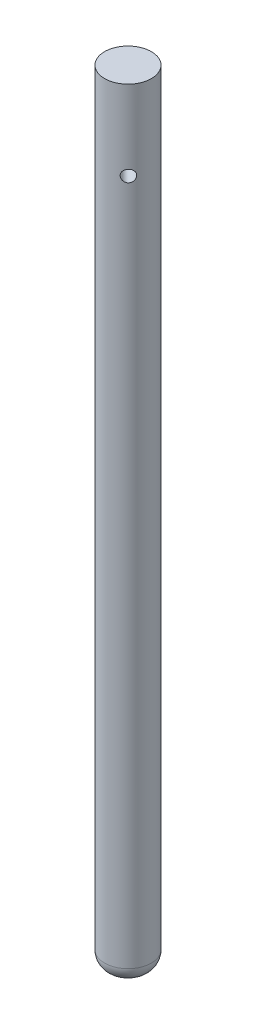
ISO-10303-21;
HEADER;
FILE_DESCRIPTION(('STEP AP214'),'2;1');
FILE_NAME('part.step','',(''),(''),'','','');
FILE_SCHEMA(('AUTOMOTIVE_DESIGN { 1 0 10303 214 1 1 1 1 }'));
ENDSEC;
DATA;
#1=APPLICATION_CONTEXT('core data for automotive mechanical design processes');
#2=APPLICATION_PROTOCOL_DEFINITION('international standard','automotive_design',2000,#1);
#3=PRODUCT_CONTEXT('',#1,'mechanical');
#4=PRODUCT('Part','Part','',(#3));
#5=PRODUCT_RELATED_PRODUCT_CATEGORY('part','',(#4));
#6=PRODUCT_DEFINITION_FORMATION('','',#4);
#7=PRODUCT_DEFINITION_CONTEXT('part definition',#1,'design');
#8=PRODUCT_DEFINITION('design','',#6,#7);
#9=PRODUCT_DEFINITION_SHAPE('','',#8);
#10=(LENGTH_UNIT() NAMED_UNIT(*) SI_UNIT(.MILLI.,.METRE.));
#11=(NAMED_UNIT(*) PLANE_ANGLE_UNIT() SI_UNIT($,.RADIAN.));
#12=(NAMED_UNIT(*) SI_UNIT($,.STERADIAN.) SOLID_ANGLE_UNIT());
#13=UNCERTAINTY_MEASURE_WITH_UNIT(LENGTH_MEASURE(1.E-05),#10,'distance_accuracy_value','');
#14=(GEOMETRIC_REPRESENTATION_CONTEXT(3) GLOBAL_UNCERTAINTY_ASSIGNED_CONTEXT((#13)) GLOBAL_UNIT_ASSIGNED_CONTEXT((#10,
#11,#12)) REPRESENTATION_CONTEXT('',''));
#15=CARTESIAN_POINT('',(0.,0.,0.));
#16=DIRECTION('',(0.,0.,1.));
#17=DIRECTION('',(1.,0.,0.));
#18=AXIS2_PLACEMENT_3D('',#15,#16,#17);
#19=CARTESIAN_POINT('',(0.,100.,0.));
#20=DIRECTION('',(0.,-1.,0.));
#21=DIRECTION('',(0.,0.,-1.));
#22=AXIS2_PLACEMENT_3D('',#19,#20,#21);
#23=CYLINDRICAL_SURFACE('',#22,2.99);
#24=CARTESIAN_POINT('',(0.,2.,0.));
#25=DIRECTION('',(0.,1.,0.));
#26=DIRECTION('',(0.,0.,1.));
#27=AXIS2_PLACEMENT_3D('',#24,#25,#26);
#28=CIRCLE('',#27,2.99);
#29=CARTESIAN_POINT('',(0.,2.,2.99));
#30=VERTEX_POINT('',#29);
#31=EDGE_CURVE('E38',#30,#30,#28,.T.);
#32=ORIENTED_EDGE('',*,*,#31,.T.);
#33=EDGE_LOOP('',(#32));
#34=FACE_BOUND('',#33,.T.);
#35=CARTESIAN_POINT('',(-1.55299666851545,89.8183221412136,-2.55505407918892));
#36=CARTESIAN_POINT('',(-1.55299804774372,89.859732546392,-2.55505379055781));
#37=CARTESIAN_POINT('',(-1.5560393059233,89.9011558507691,-2.55321228836767));
#38=CARTESIAN_POINT('',(-1.56804937479956,89.9828125872063,-2.54585330539109));
#39=CARTESIAN_POINT('',(-1.57702161185479,90.0230453174204,-2.54033369972953));
#40=CARTESIAN_POINT('',(-1.60042554352559,90.1011279634517,-2.5256538228311));
#41=CARTESIAN_POINT('',(-1.61485015941354,90.1389808949171,-2.5164982713018));
#42=CARTESIAN_POINT('',(-1.64849051817871,90.2113656455855,-2.494590195497));
#43=CARTESIAN_POINT('',(-1.66770647282616,90.2458973179003,-2.48183751223022));
#44=CARTESIAN_POINT('',(-1.71054697940308,90.311424270247,-2.45251186799045));
#45=CARTESIAN_POINT('',(-1.73425192875563,90.3423351288089,-2.43586768268884));
#46=CARTESIAN_POINT('',(-1.78486048198498,90.3989991477959,-2.39903126565123));
#47=CARTESIAN_POINT('',(-1.81176438605826,90.4247518235569,-2.37883870084291));
#48=CARTESIAN_POINT('',(-1.86815850670153,90.4707141735501,-2.3348188700079));
#49=CARTESIAN_POINT('',(-1.89767975572805,90.4908408655751,-2.31094451299995));
#50=CARTESIAN_POINT('',(-1.95788141249569,90.5244402871537,-2.26016564528618));
#51=CARTESIAN_POINT('',(-1.98856164729927,90.537914005239,-2.23326158547854));
#52=CARTESIAN_POINT('',(-2.04935977395249,90.5575544674233,-2.17758769095947));
#53=CARTESIAN_POINT('',(-2.07947637808587,90.5638645844451,-2.14886707843807));
#54=CARTESIAN_POINT('',(-2.13878946636741,90.5694488136404,-2.08983947732272));
#55=CARTESIAN_POINT('',(-2.167986086779,90.5687239727584,-2.05953272544615));
#56=CARTESIAN_POINT('',(-2.2239661984309,90.560361873068,-1.99893446421197));
#57=CARTESIAN_POINT('',(-2.25078902438457,90.5528793789343,-1.96865773574652));
#58=CARTESIAN_POINT('',(-2.30209545255079,90.5314632005164,-1.90840854431397));
#59=CARTESIAN_POINT('',(-2.32657892969058,90.5175291715348,-1.87843609769172));
#60=CARTESIAN_POINT('',(-2.37295379082373,90.4834805626645,-1.81950824333465));
#61=CARTESIAN_POINT('',(-2.39481961660715,90.4633110054897,-1.79056454319663));
#62=CARTESIAN_POINT('',(-2.43539853428552,90.4174056098257,-1.73496982987379));
#63=CARTESIAN_POINT('',(-2.45411107337477,90.391668797138,-1.70831921909261));
#64=CARTESIAN_POINT('',(-2.48867446433259,90.3345302155224,-1.65757915824247));
#65=CARTESIAN_POINT('',(-2.50443347025009,90.3029932209555,-1.63357925826237));
#66=CARTESIAN_POINT('',(-2.53234566562463,90.2355820326699,-1.58996784657587));
#67=CARTESIAN_POINT('',(-2.54449868422674,90.1997076335544,-1.57035654281592));
#68=CARTESIAN_POINT('',(-2.56520404069773,90.1243871457781,-1.53630373651336));
#69=CARTESIAN_POINT('',(-2.57373840843196,90.084924386884,-1.52188808732345));
#70=CARTESIAN_POINT('',(-2.58709252261702,90.0036987574179,-1.49907601468982));
#71=CARTESIAN_POINT('',(-2.59191307003103,89.9619363848887,-1.49067829338115));
#72=CARTESIAN_POINT('',(-2.5977496230553,89.8784866832829,-1.48048328773453));
#73=CARTESIAN_POINT('',(-2.59886335526589,89.8368268690987,-1.47851648359775));
#74=CARTESIAN_POINT('',(-2.59755764149563,89.7537374897037,-1.48080925592331));
#75=CARTESIAN_POINT('',(-2.59513852318372,89.7123079034971,-1.48506825494763));
#76=CARTESIAN_POINT('',(-2.58684412398161,89.6315606392691,-1.49946787527954));
#77=CARTESIAN_POINT('',(-2.58102651764099,89.5922193962294,-1.50951030859476));
#78=CARTESIAN_POINT('',(-2.56599648247455,89.515982286058,-1.53491972641412));
#79=CARTESIAN_POINT('',(-2.55678364942544,89.4790867107159,-1.55028734490234));
#80=CARTESIAN_POINT('',(-2.53477284551708,89.4079850861229,-1.58602459147858));
#81=CARTESIAN_POINT('',(-2.52190771279183,89.3738464809171,-1.60648694530617));
#82=CARTESIAN_POINT('',(-2.49272402155282,89.309951147698,-1.65140632623785));
#83=CARTESIAN_POINT('',(-2.47640489146903,89.2801951463052,-1.67586401433979));
#84=CARTESIAN_POINT('',(-2.4399635186789,89.225140397684,-1.72850409005155));
#85=CARTESIAN_POINT('',(-2.41975577777871,89.1999729155944,-1.75676482775476));
#86=CARTESIAN_POINT('',(-2.37604329060492,89.1557634029428,-1.81544895312219));
#87=CARTESIAN_POINT('',(-2.35253871669152,89.1367210523268,-1.84587222768683));
#88=CARTESIAN_POINT('',(-2.30280160401133,89.1054682024686,-1.90755375478344));
#89=CARTESIAN_POINT('',(-2.27659041627411,89.0932084523703,-1.93880421387145));
#90=CARTESIAN_POINT('',(-2.22187991756648,89.0757211918924,-2.00126744239292));
#91=CARTESIAN_POINT('',(-2.19338105247952,89.0704923146589,-2.03248021797317));
#92=CARTESIAN_POINT('',(-2.13567430898924,89.0672925455496,-2.09301138470092));
#93=CARTESIAN_POINT('',(-2.10650683653141,89.0691279933491,-2.1223582137819));
#94=CARTESIAN_POINT('',(-2.04761526318508,89.0795609016116,-2.17923097867894));
#95=CARTESIAN_POINT('',(-2.01789117908039,89.0881581585017,-2.20675696928662));
#96=CARTESIAN_POINT('',(-1.95900635580487,89.1117664908891,-2.25919041358641));
#97=CARTESIAN_POINT('',(-1.92984342866874,89.1267423389887,-2.28411132667306));
#98=CARTESIAN_POINT('',(-1.8728802053344,89.1626508118005,-2.33104771329306));
#99=CARTESIAN_POINT('',(-1.84508008243687,89.1835841918094,-2.35306281790934));
#100=CARTESIAN_POINT('',(-1.79115459661245,89.2314029668627,-2.39437839554105));
#101=CARTESIAN_POINT('',(-1.76508571950419,89.2584196102805,-2.41360068750511));
#102=CARTESIAN_POINT('',(-1.7163555050066,89.3173834780057,-2.44849423149075));
#103=CARTESIAN_POINT('',(-1.69369503461555,89.349331952652,-2.46416458051483));
#104=CARTESIAN_POINT('',(-1.65231910717595,89.417976123529,-2.49210313223497));
#105=CARTESIAN_POINT('',(-1.63368589472776,89.4547498268231,-2.50430177844783));
#106=CARTESIAN_POINT('',(-1.60179038352905,89.531545847047,-2.52482272376566));
#107=CARTESIAN_POINT('',(-1.5885241963499,89.5715657867395,-2.5331478299227));
#108=CARTESIAN_POINT('',(-1.56994836073983,89.6459800808891,-2.54469194389663));
#109=CARTESIAN_POINT('',(-1.56361250467652,89.680019929144,-2.54857616210269));
#110=CARTESIAN_POINT('',(-1.55513626128613,89.7488109102885,-2.55375723890201));
#111=CARTESIAN_POINT('',(-1.55299551078238,89.7835619813431,-2.55505432146772));
#112=CARTESIAN_POINT('',(-1.55299666851545,89.8183221412136,-2.55505407918892));
#113=B_SPLINE_CURVE_WITH_KNOTS('',3,(#35,#36,#37,#38,#39,#40,#41,#42,#43,#44,#45,#46,#47,#48,
#49,#50,#51,#52,#53,#54,#55,#56,#57,#58,#59,#60,#61,#62,#63,#64,#65,#66,#67,#68,#69,#70,#71,#72,
#73,#74,#75,#76,#77,#78,#79,#80,#81,#82,#83,#84,#85,#86,#87,#88,#89,#90,#91,#92,#93,#94,#95,#96,
#97,#98,#99,#100,#101,#102,#103,#104,#105,#106,#107,#108,#109,#110,#111,#112),.UNSPECIFIED.,.T.,
.F.,(4,2,2,2,2,2,2,2,2,2,2,2,2,2,2,2,2,2,2,2,2,2,2,2,2,2,2,2,2,2,2,2,2,2,2,2,2,2,4),(0.,
0.124103557163027,0.24827887235225,0.372293523570408,0.496313657028206,0.62281119042198,
0.749320603987232,0.877607866312598,1.00587606134363,1.13152914406381,1.25716352734284,
1.37999160921121,1.50282625438627,1.62677637686661,1.75074820660568,1.87809730233885,
2.0054524310238,2.13343279828125,2.2613855561581,2.38593705644259,2.51047700541285,
2.63296242342189,2.75546242881104,2.88037986896578,3.00531799673551,3.13340553180308,
3.26148637287942,3.38862454001234,3.51573798696387,3.63939191287917,3.76304211617669,
3.88601810804661,4.00900969777712,4.1349644673952,4.26095122220999,4.38930834618167,
4.51757230770759,4.62175464968435,4.7259279720389),.UNSPECIFIED.);
#114=CARTESIAN_POINT('',(-1.55299666851545,89.8183221412136,-2.55505407918892));
#115=VERTEX_POINT('',#114);
#116=EDGE_CURVE('E49',#115,#115,#113,.T.);
#117=ORIENTED_EDGE('',*,*,#116,.T.);
#118=EDGE_LOOP('',(#117));
#119=FACE_BOUND('',#118,.T.);
#120=CARTESIAN_POINT('',(2.59839143379584,89.8183221412136,1.47934511077586));
#121=CARTESIAN_POINT('',(2.59839118469763,89.7769117360352,1.4793464976892));
#122=CARTESIAN_POINT('',(2.59663734643711,89.7354884316581,1.48243913943811));
#123=CARTESIAN_POINT('',(2.58962458781693,89.6538316952208,1.49465460510247));
#124=CARTESIAN_POINT('',(2.58436364136706,89.6135989650068,1.50378091470087));
#125=CARTESIAN_POINT('',(2.57035858794245,89.5355163189755,1.52759480312713));
#126=CARTESIAN_POINT('',(2.5616189964547,89.4976633875101,1.54227517124063));
#127=CARTESIAN_POINT('',(2.54068122866365,89.4252786368416,1.57652787045173));
#128=CARTESIAN_POINT('',(2.52848289948589,89.3907469645269,1.59610041777666));
#129=CARTESIAN_POINT('',(2.50039351078183,89.3252200121801,1.63976148345396));
#130=CARTESIAN_POINT('',(2.48443355358085,89.2943091536183,1.66393240181269));
#131=CARTESIAN_POINT('',(2.44905845167306,89.2376451346312,1.71557298125511));
#132=CARTESIAN_POINT('',(2.42964298260884,89.2118924588703,1.74304295193109));
#133=CARTESIAN_POINT('',(2.38725273832515,89.165930108877,1.8006720204594));
#134=CARTESIAN_POINT('',(2.36423177819014,89.145803416852,1.83086348384049));
#135=CARTESIAN_POINT('',(2.31519406776395,89.1122039952734,1.89249169036978));
#136=CARTESIAN_POINT('',(2.28917776324464,89.0987302771881,1.92392824776549));
#137=CARTESIAN_POINT('',(2.23526407092254,89.0790898150038,1.98629256862013));
#138=CARTESIAN_POINT('',(2.20741584840652,89.0727796979821,2.01721763823734));
#139=CARTESIAN_POINT('',(2.1501073804054,89.0671954687868,2.07819336808366));
#140=CARTESIAN_POINT('',(2.12064737543509,89.0679203096688,2.10824415775574));
#141=CARTESIAN_POINT('',(2.06167364038061,89.0762824093591,2.16593315791079));
#142=CARTESIAN_POINT('',(2.03217580924291,89.0837649034928,2.19361026463969));
#143=CARTESIAN_POINT('',(1.97341743882832,89.1051810819107,2.24661751457472));
#144=CARTESIAN_POINT('',(1.94415691231533,89.1191151108923,2.27194753229205));
#145=CARTESIAN_POINT('',(1.88657840702919,89.1531637197626,2.31998746873311));
#146=CARTESIAN_POINT('',(1.85827140067923,89.1733332769374,2.34267150511057));
#147=CARTESIAN_POINT('',(1.80385904102212,89.2192386726014,2.38482261216534));
#148=CARTESIAN_POINT('',(1.77775407415641,89.2449754852892,2.404289118763));
#149=CARTESIAN_POINT('',(1.72802247498736,89.3021140669047,2.44028842172385));
#150=CARTESIAN_POINT('',(1.70448273146299,89.3336510614716,2.45672685052254));
#151=CARTESIAN_POINT('',(1.66168679483936,89.4010622497573,2.48587395481135));
#152=CARTESIAN_POINT('',(1.64243080471901,89.4369366488728,2.49858245357371));
#153=CARTESIAN_POINT('',(1.60898361546701,89.5122571366491,2.52025250052363));
#154=CARTESIAN_POINT('',(1.5948177455859,89.5517198955432,2.5291953470895));
#155=CARTESIAN_POINT('',(1.57239661827112,89.6329455250093,2.54319592112931));
#156=CARTESIAN_POINT('',(1.56414008639217,89.6747078975384,2.54825448632912));
#157=CARTESIAN_POINT('',(1.55411603921499,89.7581575991443,2.55438000422801));
#158=CARTESIAN_POINT('',(1.55218186614402,89.7998174133284,2.55554948808036));
#159=CARTESIAN_POINT('',(1.55443638790138,89.8829067927234,2.55417878569387));
#160=CARTESIAN_POINT('',(1.5586245148915,89.9243363789301,2.55163894349193));
#161=CARTESIAN_POINT('',(1.57278122018263,90.0050836431581,2.54293642551565));
#162=CARTESIAN_POINT('',(1.58265329879289,90.0444248861978,2.53683420671116));
#163=CARTESIAN_POINT('',(1.60762281670217,90.1206619963692,2.52108417031751));
#164=CARTESIAN_POINT('',(1.62272087817462,90.1575575717113,2.51143593055244));
#165=CARTESIAN_POINT('',(1.65781451319983,90.2286591963042,2.48841283210194));
#166=CARTESIAN_POINT('',(1.67790085529681,90.2627978015101,2.4749681891031));
#167=CARTESIAN_POINT('',(1.72196789067843,90.3266931347291,2.44451272965337));
#168=CARTESIAN_POINT('',(1.74594922835684,90.3564491361219,2.42750132297615));
#169=CARTESIAN_POINT('',(1.79752639819035,90.4115038847432,2.38957050735434));
#170=CARTESIAN_POINT('',(1.82519810510685,90.4366713668327,2.36856339607874));
#171=CARTESIAN_POINT('',(1.8826090651697,90.4808808794844,2.32319171140954));
#172=CARTESIAN_POINT('',(1.9123482101883,90.4999232301004,2.29882731353787));
#173=CARTESIAN_POINT('',(1.97258317851757,90.5311760799586,2.2473478054487));
#174=CARTESIAN_POINT('',(2.00307182172819,90.5434358300569,2.22025426025834));
#175=CARTESIAN_POINT('',(2.06394604484877,90.5609230905347,2.16378105824509));
#176=CARTESIAN_POINT('',(2.09433164364528,90.5661519677683,2.13440184694788));
#177=CARTESIAN_POINT('',(2.15318896862566,90.5693517368776,2.07498883754903));
#178=CARTESIAN_POINT('',(2.18169027583275,90.567516289078,2.04499461620267));
#179=CARTESIAN_POINT('',(2.23685683357891,90.5570833808155,1.98450180915357));
#180=CARTESIAN_POINT('',(2.26352213936688,90.5484861239255,1.95400323866198));
#181=CARTESIAN_POINT('',(2.31425138253551,90.524877791538,1.89364404399483));
#182=CARTESIAN_POINT('',(2.33832871128682,90.5099019434385,1.86378084811059));
#183=CARTESIAN_POINT('',(2.38361805658679,90.4739934706266,1.80549956120063));
#184=CARTESIAN_POINT('',(2.40482970932156,90.4530600906177,1.77708165394758));
#185=CARTESIAN_POINT('',(2.44458735250503,90.4052413155645,1.72199749302143));
#186=CARTESIAN_POINT('',(2.46305680806162,90.3782246721466,1.69538993632264));
#187=CARTESIAN_POINT('',(2.49654350881819,90.3192608044215,1.64568245107848));
#188=CARTESIAN_POINT('',(2.5115598761662,90.2873123297752,1.6225834149828));
#189=CARTESIAN_POINT('',(2.53830459300746,90.2186681588982,1.58042597003192));
#190=CARTESIAN_POINT('',(2.54996576477813,90.1818944556041,1.56145175994294));
#191=CARTESIAN_POINT('',(2.56956683214982,90.1050984353801,1.52898283650443));
#192=CARTESIAN_POINT('',(2.57750942253453,90.0650784956877,1.51548415609562));
#193=CARTESIAN_POINT('',(2.58851796908361,89.9906642015381,1.49658600436239));
#194=CARTESIAN_POINT('',(2.59221953741285,89.9566243532831,1.49014173442459));
#195=CARTESIAN_POINT('',(2.59715626756516,89.8878333721387,1.48152089025381));
#196=CARTESIAN_POINT('',(2.59839164289047,89.853082301084,1.47934394659189));
#197=CARTESIAN_POINT('',(2.59839143379584,89.8183221412136,1.47934511077586));
#198=B_SPLINE_CURVE_WITH_KNOTS('',3,(#120,#121,#122,#123,#124,#125,#126,#127,#128,#129,#130,
#131,#132,#133,#134,#135,#136,#137,#138,#139,#140,#141,#142,#143,#144,#145,#146,#147,#148,#149,
#150,#151,#152,#153,#154,#155,#156,#157,#158,#159,#160,#161,#162,#163,#164,#165,#166,#167,#168,
#169,#170,#171,#172,#173,#174,#175,#176,#177,#178,#179,#180,#181,#182,#183,#184,#185,#186,#187,
#188,#189,#190,#191,#192,#193,#194,#195,#196,#197),.UNSPECIFIED.,.T.,.F.,(4,2,2,2,2,2,2,2,2,2,2,
2,2,2,2,2,2,2,2,2,2,2,2,2,2,2,2,2,2,2,2,2,2,2,2,2,2,2,4),(0.,0.124103557163027,
0.248278872352249,0.372293523570393,0.496313657028206,0.62281119042198,0.749320603987232,
0.877607866312608,1.00587606134363,1.13152914406381,1.25716352734284,1.37999160921121,
1.50282625438627,1.62677637686661,1.75074820660569,1.87809730233885,2.0054524310238,
2.13343279828125,2.2613855561581,2.3859370564426,2.51047700541285,2.63296242342189,
2.75546242881104,2.88037986896577,3.00531799673551,3.13340553180308,3.26148637287942,
3.38862454001234,3.51573798696388,3.63939191287917,3.76304211617669,3.88601810804661,
4.00900969777712,4.13496446739518,4.26095122220997,4.38930834618163,4.51757230770759,
4.62175464968435,4.7259279720389),.UNSPECIFIED.);
#199=CARTESIAN_POINT('',(2.59839143379584,89.8183221412136,1.47934511077586));
#200=VERTEX_POINT('',#199);
#201=EDGE_CURVE('E42',#200,#200,#198,.T.);
#202=ORIENTED_EDGE('',*,*,#201,.T.);
#203=EDGE_LOOP('',(#202));
#204=FACE_BOUND('',#203,.T.);
#205=CARTESIAN_POINT('',(0.,100.,0.));
#206=DIRECTION('',(0.,1.,0.));
#207=DIRECTION('',(0.,0.,1.));
#208=AXIS2_PLACEMENT_3D('',#205,#206,#207);
#209=CIRCLE('',#208,2.99);
#210=CARTESIAN_POINT('',(0.,100.,2.99));
#211=VERTEX_POINT('',#210);
#212=EDGE_CURVE('E46',#211,#211,#209,.T.);
#213=ORIENTED_EDGE('',*,*,#212,.F.);
#214=EDGE_LOOP('',(#213));
#215=FACE_BOUND('',#214,.T.);
#216=ADVANCED_FACE('F31',(#34,#119,#204,#215),#23,.T.);
#217=CARTESIAN_POINT('',(0.,100.,0.));
#218=DIRECTION('',(0.,1.,0.));
#219=DIRECTION('',(0.,0.,1.));
#220=AXIS2_PLACEMENT_3D('',#217,#218,#219);
#221=PLANE('',#220);
#222=ORIENTED_EDGE('',*,*,#212,.T.);
#223=EDGE_LOOP('',(#222));
#224=FACE_BOUND('',#223,.T.);
#225=ADVANCED_FACE('F65',(#224),#221,.T.);
#226=CARTESIAN_POINT('',(0.,0.,0.));
#227=DIRECTION('',(0.,1.,0.));
#228=DIRECTION('',(0.,0.,1.));
#229=AXIS2_PLACEMENT_3D('',#226,#227,#228);
#230=PLANE('',#229);
#231=CARTESIAN_POINT('',(0.,0.,0.));
#232=DIRECTION('',(0.,1.,0.));
#233=DIRECTION('',(0.,0.,1.));
#234=AXIS2_PLACEMENT_3D('',#231,#232,#233);
#235=CIRCLE('',#234,0.99);
#236=CARTESIAN_POINT('',(0.,0.,0.99));
#237=VERTEX_POINT('',#236);
#238=EDGE_CURVE('E10',#237,#237,#235,.F.);
#239=ORIENTED_EDGE('',*,*,#238,.T.);
#240=EDGE_LOOP('',(#239));
#241=FACE_BOUND('',#240,.T.);
#242=ADVANCED_FACE('F63',(#241),#230,.F.);
#243=CARTESIAN_POINT('',(2.1442465437034,89.8183221412136,2.0838202321256));
#244=DIRECTION('',(0.717139312275386,0.,0.696929843520269));
#245=DIRECTION('',(0.696929843520269,0.,-0.717139312275386));
#246=AXIS2_PLACEMENT_3D('',#243,#244,#245);
#247=CYLINDRICAL_SURFACE('',#246,0.749999999999987);
#248=ORIENTED_EDGE('',*,*,#201,.F.);
#249=EDGE_LOOP('',(#248));
#250=FACE_BOUND('',#249,.T.);
#251=ORIENTED_EDGE('',*,*,#116,.F.);
#252=EDGE_LOOP('',(#251));
#253=FACE_BOUND('',#252,.T.);
#254=ADVANCED_FACE('F59',(#250,#253),#247,.F.);
#255=CARTESIAN_POINT('',(0.,2.,0.));
#256=DIRECTION('',(0.,1.,0.));
#257=DIRECTION('',(0.,0.,1.));
#258=AXIS2_PLACEMENT_3D('',#255,#256,#257);
#259=DEGENERATE_TOROIDAL_SURFACE('',#258,0.99,2.,.T.);
#260=ORIENTED_EDGE('',*,*,#238,.F.);
#261=EDGE_LOOP('',(#260));
#262=FACE_BOUND('',#261,.T.);
#263=ORIENTED_EDGE('',*,*,#31,.F.);
#264=EDGE_LOOP('',(#263));
#265=FACE_BOUND('',#264,.T.);
#266=ADVANCED_FACE('F33',(#262,#265),#259,.T.);
#267=CLOSED_SHELL('',(#216,#225,#242,#254,#266));
#268=MANIFOLD_SOLID_BREP('B2',#267);
#269=ADVANCED_BREP_SHAPE_REPRESENTATION('',(#18,#268),#14);
#270=SHAPE_DEFINITION_REPRESENTATION(#9,#269);
ENDSEC;
END-ISO-10303-21;
